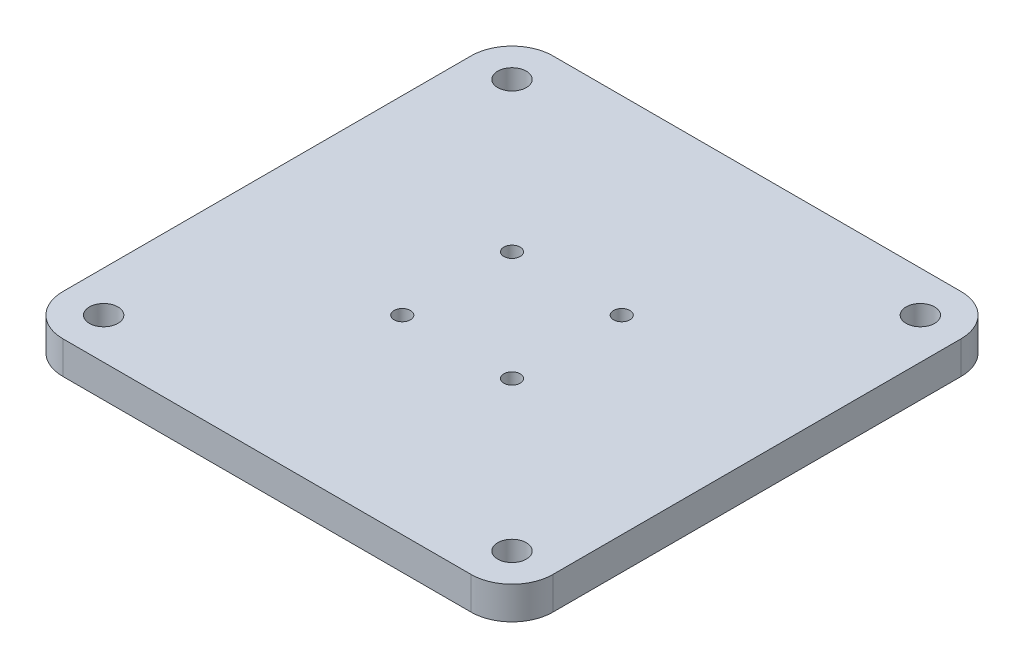
ISO-10303-21;
HEADER;
FILE_DESCRIPTION(('STEP AP214'),'2;1');
FILE_NAME('part.step','',(''),(''),'','','');
FILE_SCHEMA(('AUTOMOTIVE_DESIGN { 1 0 10303 214 1 1 1 1 }'));
ENDSEC;
DATA;
#1=APPLICATION_CONTEXT('core data for automotive mechanical design processes');
#2=APPLICATION_PROTOCOL_DEFINITION('international standard','automotive_design',2000,#1);
#3=PRODUCT_CONTEXT('',#1,'mechanical');
#4=PRODUCT('Part','Part','',(#3));
#5=PRODUCT_RELATED_PRODUCT_CATEGORY('part','',(#4));
#6=PRODUCT_DEFINITION_FORMATION('','',#4);
#7=PRODUCT_DEFINITION_CONTEXT('part definition',#1,'design');
#8=PRODUCT_DEFINITION('design','',#6,#7);
#9=PRODUCT_DEFINITION_SHAPE('','',#8);
#10=(LENGTH_UNIT() NAMED_UNIT(*) SI_UNIT(.MILLI.,.METRE.));
#11=(NAMED_UNIT(*) PLANE_ANGLE_UNIT() SI_UNIT($,.RADIAN.));
#12=(NAMED_UNIT(*) SI_UNIT($,.STERADIAN.) SOLID_ANGLE_UNIT());
#13=UNCERTAINTY_MEASURE_WITH_UNIT(LENGTH_MEASURE(1.E-05),#10,'distance_accuracy_value','');
#14=(GEOMETRIC_REPRESENTATION_CONTEXT(3) GLOBAL_UNCERTAINTY_ASSIGNED_CONTEXT((#13)) GLOBAL_UNIT_ASSIGNED_CONTEXT((#10,
#11,#12)) REPRESENTATION_CONTEXT('',''));
#15=CARTESIAN_POINT('',(0.,0.,0.));
#16=DIRECTION('',(0.,0.,1.));
#17=DIRECTION('',(1.,0.,0.));
#18=AXIS2_PLACEMENT_3D('',#15,#16,#17);
#19=CARTESIAN_POINT('',(-13.4350288425443,8.,-13.4350288425445));
#20=DIRECTION('',(0.,-1.,0.));
#21=DIRECTION('',(0.,0.,-1.));
#22=AXIS2_PLACEMENT_3D('',#19,#20,#21);
#23=CYLINDRICAL_SURFACE('',#22,2.);
#24=CARTESIAN_POINT('',(-13.4350288425443,8.,-13.4350288425445));
#25=DIRECTION('',(0.,1.,0.));
#26=DIRECTION('',(0.,0.,1.));
#27=AXIS2_PLACEMENT_3D('',#24,#25,#26);
#28=CIRCLE('',#27,2.);
#29=CARTESIAN_POINT('',(-13.4350288425443,8.,-11.4350288425445));
#30=VERTEX_POINT('',#29);
#31=EDGE_CURVE('E132',#30,#30,#28,.T.);
#32=ORIENTED_EDGE('',*,*,#31,.T.);
#33=EDGE_LOOP('',(#32));
#34=FACE_BOUND('',#33,.T.);
#35=CARTESIAN_POINT('',(-13.4350288425443,4.,-13.4350288425445));
#36=DIRECTION('',(0.,-1.,0.));
#37=DIRECTION('',(0.,0.,-1.));
#38=AXIS2_PLACEMENT_3D('',#35,#36,#37);
#39=CIRCLE('',#38,2.);
#40=CARTESIAN_POINT('',(-13.4350288425443,4.,-15.4350288425445));
#41=VERTEX_POINT('',#40);
#42=EDGE_CURVE('E171',#41,#41,#39,.T.);
#43=ORIENTED_EDGE('',*,*,#42,.T.);
#44=EDGE_LOOP('',(#43));
#45=FACE_BOUND('',#44,.T.);
#46=ADVANCED_FACE('F39',(#34,#45),#23,.F.);
#47=CARTESIAN_POINT('',(13.4350288425445,8.,-13.4350288425451));
#48=DIRECTION('',(0.,-1.,0.));
#49=DIRECTION('',(0.,0.,-1.));
#50=AXIS2_PLACEMENT_3D('',#47,#48,#49);
#51=CYLINDRICAL_SURFACE('',#50,2.00000000000078);
#52=CARTESIAN_POINT('',(13.4350288425445,8.,-13.4350288425451));
#53=DIRECTION('',(0.,1.,0.));
#54=DIRECTION('',(0.,0.,1.));
#55=AXIS2_PLACEMENT_3D('',#52,#53,#54);
#56=CIRCLE('',#55,2.00000000000078);
#57=CARTESIAN_POINT('',(13.4350288425445,8.,-11.4350288425443));
#58=VERTEX_POINT('',#57);
#59=EDGE_CURVE('E138',#58,#58,#56,.T.);
#60=ORIENTED_EDGE('',*,*,#59,.T.);
#61=EDGE_LOOP('',(#60));
#62=FACE_BOUND('',#61,.T.);
#63=CARTESIAN_POINT('',(13.4350288425445,4.,-13.4350288425451));
#64=DIRECTION('',(0.,-1.,0.));
#65=DIRECTION('',(0.,0.,-1.));
#66=AXIS2_PLACEMENT_3D('',#63,#64,#65);
#67=CIRCLE('',#66,2.00000000000078);
#68=CARTESIAN_POINT('',(13.4350288425445,4.,-15.4350288425459));
#69=VERTEX_POINT('',#68);
#70=EDGE_CURVE('E168',#69,#69,#67,.T.);
#71=ORIENTED_EDGE('',*,*,#70,.T.);
#72=EDGE_LOOP('',(#71));
#73=FACE_BOUND('',#72,.T.);
#74=ADVANCED_FACE('F296',(#62,#73),#51,.F.);
#75=CARTESIAN_POINT('',(13.4350288425451,8.,13.4350288425437));
#76=DIRECTION('',(0.,-1.,0.));
#77=DIRECTION('',(0.,0.,-1.));
#78=AXIS2_PLACEMENT_3D('',#75,#76,#77);
#79=CYLINDRICAL_SURFACE('',#78,2.00000000000106);
#80=CARTESIAN_POINT('',(13.4350288425451,8.,13.4350288425437));
#81=DIRECTION('',(0.,1.,0.));
#82=DIRECTION('',(0.,0.,1.));
#83=AXIS2_PLACEMENT_3D('',#80,#81,#82);
#84=CIRCLE('',#83,2.00000000000106);
#85=CARTESIAN_POINT('',(13.4350288425451,8.,15.4350288425448));
#86=VERTEX_POINT('',#85);
#87=EDGE_CURVE('E215',#86,#86,#84,.T.);
#88=ORIENTED_EDGE('',*,*,#87,.T.);
#89=EDGE_LOOP('',(#88));
#90=FACE_BOUND('',#89,.T.);
#91=CARTESIAN_POINT('',(13.4350288425451,4.,13.4350288425437));
#92=DIRECTION('',(0.,-1.,0.));
#93=DIRECTION('',(0.,0.,-1.));
#94=AXIS2_PLACEMENT_3D('',#91,#92,#93);
#95=CIRCLE('',#94,2.00000000000106);
#96=CARTESIAN_POINT('',(13.4350288425451,4.,11.4350288425427));
#97=VERTEX_POINT('',#96);
#98=EDGE_CURVE('E164',#97,#97,#95,.T.);
#99=ORIENTED_EDGE('',*,*,#98,.T.);
#100=EDGE_LOOP('',(#99));
#101=FACE_BOUND('',#100,.T.);
#102=ADVANCED_FACE('F302',(#90,#101),#79,.F.);
#103=CARTESIAN_POINT('',(-13.4350288425437,8.,13.4350288425443));
#104=DIRECTION('',(0.,-1.,0.));
#105=DIRECTION('',(0.,0.,-1.));
#106=AXIS2_PLACEMENT_3D('',#103,#104,#105);
#107=CYLINDRICAL_SURFACE('',#106,2.0000000000004);
#108=CARTESIAN_POINT('',(-13.4350288425437,8.,13.4350288425443));
#109=DIRECTION('',(0.,1.,0.));
#110=DIRECTION('',(0.,0.,1.));
#111=AXIS2_PLACEMENT_3D('',#108,#109,#110);
#112=CIRCLE('',#111,2.0000000000004);
#113=CARTESIAN_POINT('',(-13.4350288425437,8.,15.4350288425447));
#114=VERTEX_POINT('',#113);
#115=EDGE_CURVE('E160',#114,#114,#112,.T.);
#116=ORIENTED_EDGE('',*,*,#115,.T.);
#117=EDGE_LOOP('',(#116));
#118=FACE_BOUND('',#117,.T.);
#119=CARTESIAN_POINT('',(-13.4350288425437,4.,13.4350288425443));
#120=DIRECTION('',(0.,-1.,0.));
#121=DIRECTION('',(0.,0.,-1.));
#122=AXIS2_PLACEMENT_3D('',#119,#120,#121);
#123=CIRCLE('',#122,2.0000000000004);
#124=CARTESIAN_POINT('',(-13.4350288425437,4.,11.4350288425439));
#125=VERTEX_POINT('',#124);
#126=EDGE_CURVE('E161',#125,#125,#123,.T.);
#127=ORIENTED_EDGE('',*,*,#126,.T.);
#128=EDGE_LOOP('',(#127));
#129=FACE_BOUND('',#128,.T.);
#130=ADVANCED_FACE('F309',(#118,#129),#107,.F.);
#131=CARTESIAN_POINT('',(0.,8.,0.));
#132=DIRECTION('',(0.,1.,0.));
#133=DIRECTION('',(0.,0.,1.));
#134=AXIS2_PLACEMENT_3D('',#131,#132,#133);
#135=PLANE('',#134);
#136=CARTESIAN_POINT('',(-50.,8.,50.));
#137=DIRECTION('',(0.,1.,0.));
#138=DIRECTION('',(0.,0.,-1.));
#139=AXIS2_PLACEMENT_3D('',#136,#137,#138);
#140=CIRCLE('',#139,3.5);
#141=CARTESIAN_POINT('',(-50.,8.,46.5));
#142=VERTEX_POINT('',#141);
#143=EDGE_CURVE('E174',#142,#142,#140,.T.);
#144=ORIENTED_EDGE('',*,*,#143,.F.);
#145=EDGE_LOOP('',(#144));
#146=FACE_BOUND('',#145,.T.);
#147=CARTESIAN_POINT('',(50.,8.,50.));
#148=DIRECTION('',(0.,1.,0.));
#149=DIRECTION('',(0.,0.,1.));
#150=AXIS2_PLACEMENT_3D('',#147,#148,#149);
#151=CIRCLE('',#150,3.5);
#152=CARTESIAN_POINT('',(50.,8.,53.5));
#153=VERTEX_POINT('',#152);
#154=EDGE_CURVE('E225',#153,#153,#151,.T.);
#155=ORIENTED_EDGE('',*,*,#154,.F.);
#156=EDGE_LOOP('',(#155));
#157=FACE_BOUND('',#156,.T.);
#158=CARTESIAN_POINT('',(50.,8.,-50.));
#159=DIRECTION('',(0.,1.,0.));
#160=DIRECTION('',(0.,0.,-1.));
#161=AXIS2_PLACEMENT_3D('',#158,#159,#160);
#162=CIRCLE('',#161,3.5);
#163=CARTESIAN_POINT('',(50.,8.,-53.5));
#164=VERTEX_POINT('',#163);
#165=EDGE_CURVE('E222',#164,#164,#162,.T.);
#166=ORIENTED_EDGE('',*,*,#165,.F.);
#167=EDGE_LOOP('',(#166));
#168=FACE_BOUND('',#167,.T.);
#169=CARTESIAN_POINT('',(-50.,8.,-50.));
#170=DIRECTION('',(0.,1.,0.));
#171=DIRECTION('',(0.,0.,1.));
#172=AXIS2_PLACEMENT_3D('',#169,#170,#171);
#173=CIRCLE('',#172,3.5);
#174=CARTESIAN_POINT('',(-50.,8.,-46.5));
#175=VERTEX_POINT('',#174);
#176=EDGE_CURVE('E151',#175,#175,#173,.T.);
#177=ORIENTED_EDGE('',*,*,#176,.F.);
#178=EDGE_LOOP('',(#177));
#179=FACE_BOUND('',#178,.T.);
#180=ORIENTED_EDGE('',*,*,#87,.F.);
#181=EDGE_LOOP('',(#180));
#182=FACE_BOUND('',#181,.T.);
#183=ORIENTED_EDGE('',*,*,#31,.F.);
#184=EDGE_LOOP('',(#183));
#185=FACE_BOUND('',#184,.T.);
#186=DIRECTION('',(1.,0.,0.));
#187=VECTOR('',#186,1.);
#188=CARTESIAN_POINT('',(-60.,8.,60.));
#189=LINE('',#188,#187);
#190=CARTESIAN_POINT('',(-50.,8.,60.));
#191=VERTEX_POINT('',#190);
#192=CARTESIAN_POINT('',(50.,8.,60.));
#193=VERTEX_POINT('',#192);
#194=EDGE_CURVE('E141',#191,#193,#189,.T.);
#195=ORIENTED_EDGE('',*,*,#194,.T.);
#196=CARTESIAN_POINT('',(50.,8.,50.));
#197=DIRECTION('',(0.,1.,0.));
#198=DIRECTION('',(0.,0.,1.));
#199=AXIS2_PLACEMENT_3D('',#196,#197,#198);
#200=CIRCLE('',#199,10.);
#201=CARTESIAN_POINT('',(60.,8.,50.));
#202=VERTEX_POINT('',#201);
#203=EDGE_CURVE('E188',#193,#202,#200,.T.);
#204=ORIENTED_EDGE('',*,*,#203,.T.);
#205=DIRECTION('',(0.,0.,-1.));
#206=VECTOR('',#205,1.);
#207=CARTESIAN_POINT('',(60.,8.,-60.));
#208=LINE('',#207,#206);
#209=CARTESIAN_POINT('',(60.,8.,-50.));
#210=VERTEX_POINT('',#209);
#211=EDGE_CURVE('E125',#202,#210,#208,.T.);
#212=ORIENTED_EDGE('',*,*,#211,.T.);
#213=CARTESIAN_POINT('',(50.,8.,-50.));
#214=DIRECTION('',(0.,1.,0.));
#215=DIRECTION('',(0.,0.,1.));
#216=AXIS2_PLACEMENT_3D('',#213,#214,#215);
#217=CIRCLE('',#216,10.);
#218=CARTESIAN_POINT('',(50.,8.,-60.));
#219=VERTEX_POINT('',#218);
#220=EDGE_CURVE('E183',#210,#219,#217,.T.);
#221=ORIENTED_EDGE('',*,*,#220,.T.);
#222=DIRECTION('',(-1.,0.,0.));
#223=VECTOR('',#222,1.);
#224=CARTESIAN_POINT('',(-60.,8.,-60.));
#225=LINE('',#224,#223);
#226=CARTESIAN_POINT('',(-50.,8.,-60.));
#227=VERTEX_POINT('',#226);
#228=EDGE_CURVE('E199',#219,#227,#225,.T.);
#229=ORIENTED_EDGE('',*,*,#228,.T.);
#230=CARTESIAN_POINT('',(-50.,8.,-50.));
#231=DIRECTION('',(0.,1.,0.));
#232=DIRECTION('',(0.,0.,1.));
#233=AXIS2_PLACEMENT_3D('',#230,#231,#232);
#234=CIRCLE('',#233,10.);
#235=CARTESIAN_POINT('',(-60.,8.,-50.));
#236=VERTEX_POINT('',#235);
#237=EDGE_CURVE('E61',#227,#236,#234,.T.);
#238=ORIENTED_EDGE('',*,*,#237,.T.);
#239=DIRECTION('',(0.,0.,1.));
#240=VECTOR('',#239,1.);
#241=CARTESIAN_POINT('',(-60.,8.,-60.));
#242=LINE('',#241,#240);
#243=CARTESIAN_POINT('',(-60.,8.,50.));
#244=VERTEX_POINT('',#243);
#245=EDGE_CURVE('E207',#236,#244,#242,.T.);
#246=ORIENTED_EDGE('',*,*,#245,.T.);
#247=CARTESIAN_POINT('',(-50.,8.,50.));
#248=DIRECTION('',(0.,1.,0.));
#249=DIRECTION('',(0.,0.,1.));
#250=AXIS2_PLACEMENT_3D('',#247,#248,#249);
#251=CIRCLE('',#250,10.);
#252=EDGE_CURVE('E186',#244,#191,#251,.T.);
#253=ORIENTED_EDGE('',*,*,#252,.T.);
#254=EDGE_LOOP('',(#195,#204,#212,#221,#229,#238,#246,#253));
#255=FACE_BOUND('',#254,.T.);
#256=ORIENTED_EDGE('',*,*,#59,.F.);
#257=EDGE_LOOP('',(#256));
#258=FACE_BOUND('',#257,.T.);
#259=ORIENTED_EDGE('',*,*,#115,.F.);
#260=EDGE_LOOP('',(#259));
#261=FACE_BOUND('',#260,.T.);
#262=ADVANCED_FACE('F265',(#146,#157,#168,#179,#182,#185,#255,#258,#261),#135,.T.);
#263=CARTESIAN_POINT('',(0.,0.,0.));
#264=DIRECTION('',(0.,1.,0.));
#265=DIRECTION('',(0.,0.,1.));
#266=AXIS2_PLACEMENT_3D('',#263,#264,#265);
#267=PLANE('',#266);
#268=CARTESIAN_POINT('',(13.4350288425451,0.,13.4350288425437));
#269=DIRECTION('',(0.,-1.,0.));
#270=DIRECTION('',(0.,0.,-1.));
#271=AXIS2_PLACEMENT_3D('',#268,#269,#270);
#272=CIRCLE('',#271,3.5);
#273=CARTESIAN_POINT('',(13.4350288425451,0.,9.93502884254371));
#274=VERTEX_POINT('',#273);
#275=EDGE_CURVE('E243',#274,#274,#272,.T.);
#276=ORIENTED_EDGE('',*,*,#275,.F.);
#277=EDGE_LOOP('',(#276));
#278=FACE_BOUND('',#277,.T.);
#279=CARTESIAN_POINT('',(-13.4350288425443,0.,-13.4350288425445));
#280=DIRECTION('',(0.,-1.,0.));
#281=DIRECTION('',(0.,0.,-1.));
#282=AXIS2_PLACEMENT_3D('',#279,#280,#281);
#283=CIRCLE('',#282,3.5);
#284=CARTESIAN_POINT('',(-13.4350288425443,0.,-16.9350288425445));
#285=VERTEX_POINT('',#284);
#286=EDGE_CURVE('E236',#285,#285,#283,.T.);
#287=ORIENTED_EDGE('',*,*,#286,.F.);
#288=EDGE_LOOP('',(#287));
#289=FACE_BOUND('',#288,.T.);
#290=CARTESIAN_POINT('',(13.4350288425445,0.,-13.4350288425451));
#291=DIRECTION('',(0.,-1.,0.));
#292=DIRECTION('',(0.,0.,-1.));
#293=AXIS2_PLACEMENT_3D('',#290,#291,#292);
#294=CIRCLE('',#293,3.5);
#295=CARTESIAN_POINT('',(13.4350288425445,0.,-16.9350288425451));
#296=VERTEX_POINT('',#295);
#297=EDGE_CURVE('E248',#296,#296,#294,.T.);
#298=ORIENTED_EDGE('',*,*,#297,.F.);
#299=EDGE_LOOP('',(#298));
#300=FACE_BOUND('',#299,.T.);
#301=CARTESIAN_POINT('',(-13.4350288425437,0.,13.4350288425443));
#302=DIRECTION('',(0.,-1.,0.));
#303=DIRECTION('',(0.,0.,-1.));
#304=AXIS2_PLACEMENT_3D('',#301,#302,#303);
#305=CIRCLE('',#304,3.5);
#306=CARTESIAN_POINT('',(-13.4350288425437,0.,9.93502884254433));
#307=VERTEX_POINT('',#306);
#308=EDGE_CURVE('E230',#307,#307,#305,.T.);
#309=ORIENTED_EDGE('',*,*,#308,.F.);
#310=EDGE_LOOP('',(#309));
#311=FACE_BOUND('',#310,.T.);
#312=CARTESIAN_POINT('',(-50.,0.,50.));
#313=DIRECTION('',(0.,1.,0.));
#314=DIRECTION('',(0.,0.,1.));
#315=AXIS2_PLACEMENT_3D('',#312,#313,#314);
#316=CIRCLE('',#315,3.5);
#317=CARTESIAN_POINT('',(-50.,0.,53.5));
#318=VERTEX_POINT('',#317);
#319=EDGE_CURVE('E157',#318,#318,#316,.T.);
#320=ORIENTED_EDGE('',*,*,#319,.T.);
#321=EDGE_LOOP('',(#320));
#322=FACE_BOUND('',#321,.T.);
#323=CARTESIAN_POINT('',(50.,0.,50.));
#324=DIRECTION('',(0.,1.,0.));
#325=DIRECTION('',(0.,0.,1.));
#326=AXIS2_PLACEMENT_3D('',#323,#324,#325);
#327=CIRCLE('',#326,3.5);
#328=CARTESIAN_POINT('',(50.,0.,53.5));
#329=VERTEX_POINT('',#328);
#330=EDGE_CURVE('E154',#329,#329,#327,.T.);
#331=ORIENTED_EDGE('',*,*,#330,.T.);
#332=EDGE_LOOP('',(#331));
#333=FACE_BOUND('',#332,.T.);
#334=CARTESIAN_POINT('',(50.,0.,-50.));
#335=DIRECTION('',(0.,1.,0.));
#336=DIRECTION('',(0.,0.,1.));
#337=AXIS2_PLACEMENT_3D('',#334,#335,#336);
#338=CIRCLE('',#337,3.5);
#339=CARTESIAN_POINT('',(50.,0.,-46.5));
#340=VERTEX_POINT('',#339);
#341=EDGE_CURVE('E150',#340,#340,#338,.T.);
#342=ORIENTED_EDGE('',*,*,#341,.T.);
#343=EDGE_LOOP('',(#342));
#344=FACE_BOUND('',#343,.T.);
#345=CARTESIAN_POINT('',(-50.,0.,-50.));
#346=DIRECTION('',(0.,1.,0.));
#347=DIRECTION('',(0.,0.,1.));
#348=AXIS2_PLACEMENT_3D('',#345,#346,#347);
#349=CIRCLE('',#348,3.5);
#350=CARTESIAN_POINT('',(-50.,0.,-46.5));
#351=VERTEX_POINT('',#350);
#352=EDGE_CURVE('E147',#351,#351,#349,.T.);
#353=ORIENTED_EDGE('',*,*,#352,.T.);
#354=EDGE_LOOP('',(#353));
#355=FACE_BOUND('',#354,.T.);
#356=DIRECTION('',(0.,0.,-1.));
#357=VECTOR('',#356,1.);
#358=CARTESIAN_POINT('',(60.,0.,-60.));
#359=LINE('',#358,#357);
#360=CARTESIAN_POINT('',(60.,0.,50.));
#361=VERTEX_POINT('',#360);
#362=CARTESIAN_POINT('',(60.,0.,-50.));
#363=VERTEX_POINT('',#362);
#364=EDGE_CURVE('E122',#361,#363,#359,.T.);
#365=ORIENTED_EDGE('',*,*,#364,.F.);
#366=CARTESIAN_POINT('',(50.,0.,50.));
#367=DIRECTION('',(0.,1.,0.));
#368=DIRECTION('',(0.,0.,1.));
#369=AXIS2_PLACEMENT_3D('',#366,#367,#368);
#370=CIRCLE('',#369,10.);
#371=CARTESIAN_POINT('',(50.,0.,60.));
#372=VERTEX_POINT('',#371);
#373=EDGE_CURVE('E105',#361,#372,#370,.F.);
#374=ORIENTED_EDGE('',*,*,#373,.T.);
#375=DIRECTION('',(1.,0.,0.));
#376=VECTOR('',#375,1.);
#377=CARTESIAN_POINT('',(-60.,0.,60.));
#378=LINE('',#377,#376);
#379=CARTESIAN_POINT('',(-50.,0.,60.));
#380=VERTEX_POINT('',#379);
#381=EDGE_CURVE('E145',#380,#372,#378,.T.);
#382=ORIENTED_EDGE('',*,*,#381,.F.);
#383=CARTESIAN_POINT('',(-50.,0.,50.));
#384=DIRECTION('',(0.,1.,0.));
#385=DIRECTION('',(0.,0.,1.));
#386=AXIS2_PLACEMENT_3D('',#383,#384,#385);
#387=CIRCLE('',#386,10.);
#388=CARTESIAN_POINT('',(-60.,0.,50.));
#389=VERTEX_POINT('',#388);
#390=EDGE_CURVE('E116',#380,#389,#387,.F.);
#391=ORIENTED_EDGE('',*,*,#390,.T.);
#392=DIRECTION('',(0.,0.,1.));
#393=VECTOR('',#392,1.);
#394=CARTESIAN_POINT('',(-60.,0.,-60.));
#395=LINE('',#394,#393);
#396=CARTESIAN_POINT('',(-60.,0.,-50.));
#397=VERTEX_POINT('',#396);
#398=EDGE_CURVE('E135',#397,#389,#395,.T.);
#399=ORIENTED_EDGE('',*,*,#398,.F.);
#400=CARTESIAN_POINT('',(-50.,0.,-50.));
#401=DIRECTION('',(0.,1.,0.));
#402=DIRECTION('',(0.,0.,1.));
#403=AXIS2_PLACEMENT_3D('',#400,#401,#402);
#404=CIRCLE('',#403,10.);
#405=CARTESIAN_POINT('',(-50.,0.,-60.));
#406=VERTEX_POINT('',#405);
#407=EDGE_CURVE('E177',#397,#406,#404,.F.);
#408=ORIENTED_EDGE('',*,*,#407,.T.);
#409=DIRECTION('',(-1.,0.,0.));
#410=VECTOR('',#409,1.);
#411=CARTESIAN_POINT('',(-60.,0.,-60.));
#412=LINE('',#411,#410);
#413=CARTESIAN_POINT('',(50.,0.,-60.));
#414=VERTEX_POINT('',#413);
#415=EDGE_CURVE('E131',#414,#406,#412,.T.);
#416=ORIENTED_EDGE('',*,*,#415,.F.);
#417=CARTESIAN_POINT('',(50.,0.,-50.));
#418=DIRECTION('',(0.,1.,0.));
#419=DIRECTION('',(0.,0.,1.));
#420=AXIS2_PLACEMENT_3D('',#417,#418,#419);
#421=CIRCLE('',#420,10.);
#422=EDGE_CURVE('E126',#414,#363,#421,.F.);
#423=ORIENTED_EDGE('',*,*,#422,.T.);
#424=EDGE_LOOP('',(#365,#374,#382,#391,#399,#408,#416,#423));
#425=FACE_BOUND('',#424,.T.);
#426=ADVANCED_FACE('F129',(#278,#289,#300,#311,#322,#333,#344,#355,#425),#267,.F.);
#427=CARTESIAN_POINT('',(60.,8.,-60.));
#428=DIRECTION('',(-1.,0.,0.));
#429=DIRECTION('',(0.,0.,1.));
#430=AXIS2_PLACEMENT_3D('',#427,#428,#429);
#431=PLANE('',#430);
#432=ORIENTED_EDGE('',*,*,#211,.F.);
#433=DIRECTION('',(0.,-1.,0.));
#434=VECTOR('',#433,1.);
#435=CARTESIAN_POINT('',(60.,8.,50.));
#436=LINE('',#435,#434);
#437=EDGE_CURVE('E109',#202,#361,#436,.T.);
#438=ORIENTED_EDGE('',*,*,#437,.T.);
#439=ORIENTED_EDGE('',*,*,#364,.T.);
#440=DIRECTION('',(0.,-1.,0.));
#441=VECTOR('',#440,1.);
#442=CARTESIAN_POINT('',(60.,8.,-50.));
#443=LINE('',#442,#441);
#444=EDGE_CURVE('E127',#363,#210,#443,.F.);
#445=ORIENTED_EDGE('',*,*,#444,.T.);
#446=EDGE_LOOP('',(#432,#438,#439,#445));
#447=FACE_BOUND('',#446,.T.);
#448=ADVANCED_FACE('F121',(#447),#431,.F.);
#449=CARTESIAN_POINT('',(-60.,8.,-60.));
#450=DIRECTION('',(0.,0.,1.));
#451=DIRECTION('',(1.,0.,0.));
#452=AXIS2_PLACEMENT_3D('',#449,#450,#451);
#453=PLANE('',#452);
#454=ORIENTED_EDGE('',*,*,#415,.T.);
#455=DIRECTION('',(0.,-1.,0.));
#456=VECTOR('',#455,1.);
#457=CARTESIAN_POINT('',(-50.,8.,-60.));
#458=LINE('',#457,#456);
#459=EDGE_CURVE('E11',#406,#227,#458,.F.);
#460=ORIENTED_EDGE('',*,*,#459,.T.);
#461=ORIENTED_EDGE('',*,*,#228,.F.);
#462=DIRECTION('',(0.,-1.,0.));
#463=VECTOR('',#462,1.);
#464=CARTESIAN_POINT('',(50.,8.,-60.));
#465=LINE('',#464,#463);
#466=EDGE_CURVE('E47',#219,#414,#465,.T.);
#467=ORIENTED_EDGE('',*,*,#466,.T.);
#468=EDGE_LOOP('',(#454,#460,#461,#467));
#469=FACE_BOUND('',#468,.T.);
#470=ADVANCED_FACE('F197',(#469),#453,.F.);
#471=CARTESIAN_POINT('',(-60.,8.,-60.));
#472=DIRECTION('',(1.,0.,0.));
#473=DIRECTION('',(0.,0.,-1.));
#474=AXIS2_PLACEMENT_3D('',#471,#472,#473);
#475=PLANE('',#474);
#476=ORIENTED_EDGE('',*,*,#398,.T.);
#477=DIRECTION('',(0.,-1.,0.));
#478=VECTOR('',#477,1.);
#479=CARTESIAN_POINT('',(-60.,8.,50.));
#480=LINE('',#479,#478);
#481=EDGE_CURVE('E54',#389,#244,#480,.F.);
#482=ORIENTED_EDGE('',*,*,#481,.T.);
#483=ORIENTED_EDGE('',*,*,#245,.F.);
#484=DIRECTION('',(0.,-1.,0.));
#485=VECTOR('',#484,1.);
#486=CARTESIAN_POINT('',(-60.,8.,-50.));
#487=LINE('',#486,#485);
#488=EDGE_CURVE('E190',#236,#397,#487,.T.);
#489=ORIENTED_EDGE('',*,*,#488,.T.);
#490=EDGE_LOOP('',(#476,#482,#483,#489));
#491=FACE_BOUND('',#490,.T.);
#492=ADVANCED_FACE('F206',(#491),#475,.F.);
#493=CARTESIAN_POINT('',(-60.,8.,60.));
#494=DIRECTION('',(0.,0.,-1.));
#495=DIRECTION('',(-1.,0.,0.));
#496=AXIS2_PLACEMENT_3D('',#493,#494,#495);
#497=PLANE('',#496);
#498=ORIENTED_EDGE('',*,*,#381,.T.);
#499=DIRECTION('',(0.,-1.,0.));
#500=VECTOR('',#499,1.);
#501=CARTESIAN_POINT('',(50.,8.,60.));
#502=LINE('',#501,#500);
#503=EDGE_CURVE('E110',#372,#193,#502,.F.);
#504=ORIENTED_EDGE('',*,*,#503,.T.);
#505=ORIENTED_EDGE('',*,*,#194,.F.);
#506=DIRECTION('',(0.,-1.,0.));
#507=VECTOR('',#506,1.);
#508=CARTESIAN_POINT('',(-50.,8.,60.));
#509=LINE('',#508,#507);
#510=EDGE_CURVE('E115',#191,#380,#509,.T.);
#511=ORIENTED_EDGE('',*,*,#510,.T.);
#512=EDGE_LOOP('',(#498,#504,#505,#511));
#513=FACE_BOUND('',#512,.T.);
#514=ADVANCED_FACE('F281',(#513),#497,.F.);
#515=CARTESIAN_POINT('',(-50.,-2.,-50.));
#516=DIRECTION('',(0.,1.,0.));
#517=DIRECTION('',(0.,0.,1.));
#518=AXIS2_PLACEMENT_3D('',#515,#516,#517);
#519=CYLINDRICAL_SURFACE('',#518,3.5);
#520=ORIENTED_EDGE('',*,*,#176,.T.);
#521=EDGE_LOOP('',(#520));
#522=FACE_BOUND('',#521,.T.);
#523=ORIENTED_EDGE('',*,*,#352,.F.);
#524=EDGE_LOOP('',(#523));
#525=FACE_BOUND('',#524,.T.);
#526=ADVANCED_FACE('F278',(#522,#525),#519,.F.);
#527=CARTESIAN_POINT('',(50.,-2.,-50.));
#528=DIRECTION('',(0.,1.,0.));
#529=DIRECTION('',(0.,0.,1.));
#530=AXIS2_PLACEMENT_3D('',#527,#528,#529);
#531=CYLINDRICAL_SURFACE('',#530,3.5);
#532=ORIENTED_EDGE('',*,*,#165,.T.);
#533=EDGE_LOOP('',(#532));
#534=FACE_BOUND('',#533,.T.);
#535=ORIENTED_EDGE('',*,*,#341,.F.);
#536=EDGE_LOOP('',(#535));
#537=FACE_BOUND('',#536,.T.);
#538=ADVANCED_FACE('F280',(#534,#537),#531,.F.);
#539=CARTESIAN_POINT('',(50.,-2.,50.));
#540=DIRECTION('',(0.,1.,0.));
#541=DIRECTION('',(0.,0.,1.));
#542=AXIS2_PLACEMENT_3D('',#539,#540,#541);
#543=CYLINDRICAL_SURFACE('',#542,3.5);
#544=ORIENTED_EDGE('',*,*,#154,.T.);
#545=EDGE_LOOP('',(#544));
#546=FACE_BOUND('',#545,.T.);
#547=ORIENTED_EDGE('',*,*,#330,.F.);
#548=EDGE_LOOP('',(#547));
#549=FACE_BOUND('',#548,.T.);
#550=ADVANCED_FACE('F288',(#546,#549),#543,.F.);
#551=CARTESIAN_POINT('',(-50.,-2.,50.));
#552=DIRECTION('',(0.,1.,0.));
#553=DIRECTION('',(0.,0.,1.));
#554=AXIS2_PLACEMENT_3D('',#551,#552,#553);
#555=CYLINDRICAL_SURFACE('',#554,3.5);
#556=ORIENTED_EDGE('',*,*,#143,.T.);
#557=EDGE_LOOP('',(#556));
#558=FACE_BOUND('',#557,.T.);
#559=ORIENTED_EDGE('',*,*,#319,.F.);
#560=EDGE_LOOP('',(#559));
#561=FACE_BOUND('',#560,.T.);
#562=ADVANCED_FACE('F351',(#558,#561),#555,.F.);
#563=CARTESIAN_POINT('',(-13.4350288425437,4.,13.4350288425443));
#564=DIRECTION('',(0.,-1.,0.));
#565=DIRECTION('',(0.,0.,-1.));
#566=AXIS2_PLACEMENT_3D('',#563,#564,#565);
#567=CYLINDRICAL_SURFACE('',#566,3.5);
#568=CARTESIAN_POINT('',(-13.4350288425437,4.,13.4350288425443));
#569=DIRECTION('',(0.,-1.,0.));
#570=DIRECTION('',(0.,0.,-1.));
#571=AXIS2_PLACEMENT_3D('',#568,#569,#570);
#572=CIRCLE('',#571,3.5);
#573=CARTESIAN_POINT('',(-13.4350288425437,4.,9.93502884254433));
#574=VERTEX_POINT('',#573);
#575=EDGE_CURVE('E165',#574,#574,#572,.T.);
#576=ORIENTED_EDGE('',*,*,#575,.F.);
#577=EDGE_LOOP('',(#576));
#578=FACE_BOUND('',#577,.T.);
#579=ORIENTED_EDGE('',*,*,#308,.T.);
#580=EDGE_LOOP('',(#579));
#581=FACE_BOUND('',#580,.T.);
#582=ADVANCED_FACE('F345',(#578,#581),#567,.F.);
#583=CARTESIAN_POINT('',(-13.4350288425437,4.,13.4350288425443));
#584=DIRECTION('',(0.,-1.,0.));
#585=DIRECTION('',(0.,0.,-1.));
#586=AXIS2_PLACEMENT_3D('',#583,#584,#585);
#587=PLANE('',#586);
#588=ORIENTED_EDGE('',*,*,#126,.F.);
#589=EDGE_LOOP('',(#588));
#590=FACE_BOUND('',#589,.T.);
#591=ORIENTED_EDGE('',*,*,#575,.T.);
#592=EDGE_LOOP('',(#591));
#593=FACE_BOUND('',#592,.T.);
#594=ADVANCED_FACE('F341',(#590,#593),#587,.T.);
#595=CARTESIAN_POINT('',(13.4350288425451,4.,13.4350288425437));
#596=DIRECTION('',(0.,-1.,0.));
#597=DIRECTION('',(0.,0.,-1.));
#598=AXIS2_PLACEMENT_3D('',#595,#596,#597);
#599=CYLINDRICAL_SURFACE('',#598,3.5);
#600=CARTESIAN_POINT('',(13.4350288425451,4.,13.4350288425437));
#601=DIRECTION('',(0.,-1.,0.));
#602=DIRECTION('',(0.,0.,-1.));
#603=AXIS2_PLACEMENT_3D('',#600,#601,#602);
#604=CIRCLE('',#603,3.5);
#605=CARTESIAN_POINT('',(13.4350288425451,4.,9.93502884254371));
#606=VERTEX_POINT('',#605);
#607=EDGE_CURVE('E233',#606,#606,#604,.T.);
#608=ORIENTED_EDGE('',*,*,#607,.F.);
#609=EDGE_LOOP('',(#608));
#610=FACE_BOUND('',#609,.T.);
#611=ORIENTED_EDGE('',*,*,#275,.T.);
#612=EDGE_LOOP('',(#611));
#613=FACE_BOUND('',#612,.T.);
#614=ADVANCED_FACE('F344',(#610,#613),#599,.F.);
#615=CARTESIAN_POINT('',(13.4350288425451,4.,13.4350288425437));
#616=DIRECTION('',(0.,-1.,0.));
#617=DIRECTION('',(0.,0.,-1.));
#618=AXIS2_PLACEMENT_3D('',#615,#616,#617);
#619=PLANE('',#618);
#620=ORIENTED_EDGE('',*,*,#98,.F.);
#621=EDGE_LOOP('',(#620));
#622=FACE_BOUND('',#621,.T.);
#623=ORIENTED_EDGE('',*,*,#607,.T.);
#624=EDGE_LOOP('',(#623));
#625=FACE_BOUND('',#624,.T.);
#626=ADVANCED_FACE('F259',(#622,#625),#619,.T.);
#627=CARTESIAN_POINT('',(13.4350288425445,4.,-13.4350288425451));
#628=DIRECTION('',(0.,-1.,0.));
#629=DIRECTION('',(0.,0.,-1.));
#630=AXIS2_PLACEMENT_3D('',#627,#628,#629);
#631=CYLINDRICAL_SURFACE('',#630,3.5);
#632=CARTESIAN_POINT('',(13.4350288425445,4.,-13.4350288425451));
#633=DIRECTION('',(0.,-1.,0.));
#634=DIRECTION('',(0.,0.,-1.));
#635=AXIS2_PLACEMENT_3D('',#632,#633,#634);
#636=CIRCLE('',#635,3.5);
#637=CARTESIAN_POINT('',(13.4350288425445,4.,-16.9350288425451));
#638=VERTEX_POINT('',#637);
#639=EDGE_CURVE('E240',#638,#638,#636,.T.);
#640=ORIENTED_EDGE('',*,*,#639,.F.);
#641=EDGE_LOOP('',(#640));
#642=FACE_BOUND('',#641,.T.);
#643=ORIENTED_EDGE('',*,*,#297,.T.);
#644=EDGE_LOOP('',(#643));
#645=FACE_BOUND('',#644,.T.);
#646=ADVANCED_FACE('F256',(#642,#645),#631,.F.);
#647=CARTESIAN_POINT('',(13.4350288425445,4.,-13.4350288425451));
#648=DIRECTION('',(0.,-1.,0.));
#649=DIRECTION('',(0.,0.,-1.));
#650=AXIS2_PLACEMENT_3D('',#647,#648,#649);
#651=PLANE('',#650);
#652=ORIENTED_EDGE('',*,*,#70,.F.);
#653=EDGE_LOOP('',(#652));
#654=FACE_BOUND('',#653,.T.);
#655=ORIENTED_EDGE('',*,*,#639,.T.);
#656=EDGE_LOOP('',(#655));
#657=FACE_BOUND('',#656,.T.);
#658=ADVANCED_FACE('F254',(#654,#657),#651,.T.);
#659=CARTESIAN_POINT('',(-13.4350288425443,4.,-13.4350288425445));
#660=DIRECTION('',(0.,-1.,0.));
#661=DIRECTION('',(0.,0.,-1.));
#662=AXIS2_PLACEMENT_3D('',#659,#660,#661);
#663=CYLINDRICAL_SURFACE('',#662,3.5);
#664=CARTESIAN_POINT('',(-13.4350288425443,4.,-13.4350288425445));
#665=DIRECTION('',(0.,-1.,0.));
#666=DIRECTION('',(0.,0.,-1.));
#667=AXIS2_PLACEMENT_3D('',#664,#665,#666);
#668=CIRCLE('',#667,3.5);
#669=CARTESIAN_POINT('',(-13.4350288425443,4.,-16.9350288425445));
#670=VERTEX_POINT('',#669);
#671=EDGE_CURVE('E239',#670,#670,#668,.T.);
#672=ORIENTED_EDGE('',*,*,#671,.F.);
#673=EDGE_LOOP('',(#672));
#674=FACE_BOUND('',#673,.T.);
#675=ORIENTED_EDGE('',*,*,#286,.T.);
#676=EDGE_LOOP('',(#675));
#677=FACE_BOUND('',#676,.T.);
#678=ADVANCED_FACE('F391',(#674,#677),#663,.F.);
#679=CARTESIAN_POINT('',(-13.4350288425443,4.,-13.4350288425445));
#680=DIRECTION('',(0.,-1.,0.));
#681=DIRECTION('',(0.,0.,-1.));
#682=AXIS2_PLACEMENT_3D('',#679,#680,#681);
#683=PLANE('',#682);
#684=ORIENTED_EDGE('',*,*,#42,.F.);
#685=EDGE_LOOP('',(#684));
#686=FACE_BOUND('',#685,.T.);
#687=ORIENTED_EDGE('',*,*,#671,.T.);
#688=EDGE_LOOP('',(#687));
#689=FACE_BOUND('',#688,.T.);
#690=ADVANCED_FACE('F321',(#686,#689),#683,.T.);
#691=CARTESIAN_POINT('',(50.,8.,50.));
#692=DIRECTION('',(0.,-1.,0.));
#693=DIRECTION('',(0.,0.,-1.));
#694=AXIS2_PLACEMENT_3D('',#691,#692,#693);
#695=CYLINDRICAL_SURFACE('',#694,10.);
#696=ORIENTED_EDGE('',*,*,#203,.F.);
#697=ORIENTED_EDGE('',*,*,#503,.F.);
#698=ORIENTED_EDGE('',*,*,#373,.F.);
#699=ORIENTED_EDGE('',*,*,#437,.F.);
#700=EDGE_LOOP('',(#696,#697,#698,#699));
#701=FACE_BOUND('',#700,.T.);
#702=ADVANCED_FACE('F108',(#701),#695,.T.);
#703=CARTESIAN_POINT('',(-50.,8.,50.));
#704=DIRECTION('',(0.,-1.,0.));
#705=DIRECTION('',(0.,0.,-1.));
#706=AXIS2_PLACEMENT_3D('',#703,#704,#705);
#707=CYLINDRICAL_SURFACE('',#706,10.);
#708=ORIENTED_EDGE('',*,*,#252,.F.);
#709=ORIENTED_EDGE('',*,*,#481,.F.);
#710=ORIENTED_EDGE('',*,*,#390,.F.);
#711=ORIENTED_EDGE('',*,*,#510,.F.);
#712=EDGE_LOOP('',(#708,#709,#710,#711));
#713=FACE_BOUND('',#712,.T.);
#714=ADVANCED_FACE('F320',(#713),#707,.T.);
#715=CARTESIAN_POINT('',(-50.,8.,-50.));
#716=DIRECTION('',(0.,-1.,0.));
#717=DIRECTION('',(0.,0.,-1.));
#718=AXIS2_PLACEMENT_3D('',#715,#716,#717);
#719=CYLINDRICAL_SURFACE('',#718,10.);
#720=ORIENTED_EDGE('',*,*,#237,.F.);
#721=ORIENTED_EDGE('',*,*,#459,.F.);
#722=ORIENTED_EDGE('',*,*,#407,.F.);
#723=ORIENTED_EDGE('',*,*,#488,.F.);
#724=EDGE_LOOP('',(#720,#721,#722,#723));
#725=FACE_BOUND('',#724,.T.);
#726=ADVANCED_FACE('F205',(#725),#719,.T.);
#727=CARTESIAN_POINT('',(50.,8.,-50.));
#728=DIRECTION('',(0.,-1.,0.));
#729=DIRECTION('',(0.,0.,-1.));
#730=AXIS2_PLACEMENT_3D('',#727,#728,#729);
#731=CYLINDRICAL_SURFACE('',#730,10.);
#732=ORIENTED_EDGE('',*,*,#220,.F.);
#733=ORIENTED_EDGE('',*,*,#444,.F.);
#734=ORIENTED_EDGE('',*,*,#422,.F.);
#735=ORIENTED_EDGE('',*,*,#466,.F.);
#736=EDGE_LOOP('',(#732,#733,#734,#735));
#737=FACE_BOUND('',#736,.T.);
#738=ADVANCED_FACE('F41',(#737),#731,.T.);
#739=CLOSED_SHELL('',(#46,#74,#102,#130,#262,#426,#448,#470,#492,#514,#526,#538,#550,#562,#582,
#594,#614,#626,#646,#658,#678,#690,#702,#714,#726,#738));
#740=MANIFOLD_SOLID_BREP('B2',#739);
#741=ADVANCED_BREP_SHAPE_REPRESENTATION('',(#18,#740),#14);
#742=SHAPE_DEFINITION_REPRESENTATION(#9,#741);
ENDSEC;
END-ISO-10303-21;
